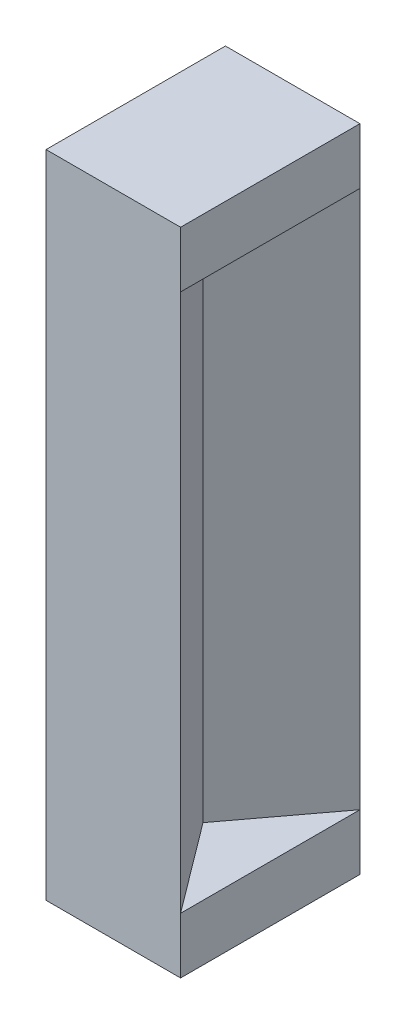
ISO-10303-21;
HEADER;
FILE_DESCRIPTION(('STEP AP214'),'2;1');
FILE_NAME('part.step','',(''),(''),'','','');
FILE_SCHEMA(('AUTOMOTIVE_DESIGN { 1 0 10303 214 1 1 1 1 }'));
ENDSEC;
DATA;
#1=APPLICATION_CONTEXT('core data for automotive mechanical design processes');
#2=APPLICATION_PROTOCOL_DEFINITION('international standard','automotive_design',2000,#1);
#3=PRODUCT_CONTEXT('',#1,'mechanical');
#4=PRODUCT('Part','Part','',(#3));
#5=PRODUCT_RELATED_PRODUCT_CATEGORY('part','',(#4));
#6=PRODUCT_DEFINITION_FORMATION('','',#4);
#7=PRODUCT_DEFINITION_CONTEXT('part definition',#1,'design');
#8=PRODUCT_DEFINITION('design','',#6,#7);
#9=PRODUCT_DEFINITION_SHAPE('','',#8);
#10=(LENGTH_UNIT() NAMED_UNIT(*) SI_UNIT(.MILLI.,.METRE.));
#11=(NAMED_UNIT(*) PLANE_ANGLE_UNIT() SI_UNIT($,.RADIAN.));
#12=(NAMED_UNIT(*) SI_UNIT($,.STERADIAN.) SOLID_ANGLE_UNIT());
#13=UNCERTAINTY_MEASURE_WITH_UNIT(LENGTH_MEASURE(1.E-05),#10,'distance_accuracy_value','');
#14=(GEOMETRIC_REPRESENTATION_CONTEXT(3) GLOBAL_UNCERTAINTY_ASSIGNED_CONTEXT((#13)) GLOBAL_UNIT_ASSIGNED_CONTEXT((#10,
#11,#12)) REPRESENTATION_CONTEXT('',''));
#15=CARTESIAN_POINT('',(0.,0.,0.));
#16=DIRECTION('',(0.,0.,1.));
#17=DIRECTION('',(1.,0.,0.));
#18=AXIS2_PLACEMENT_3D('',#15,#16,#17);
#19=CARTESIAN_POINT('',(0.,-266.540919600127,0.));
#20=DIRECTION('',(0.,1.,0.));
#21=DIRECTION('',(0.,0.,1.));
#22=AXIS2_PLACEMENT_3D('',#19,#20,#21);
#23=PLANE('',#22);
#24=DIRECTION('',(0.,0.,-1.));
#25=VECTOR('',#24,1.);
#26=CARTESIAN_POINT('',(180.,-266.540919600127,0.));
#27=LINE('',#26,#25);
#28=CARTESIAN_POINT('',(180.,-266.540919600127,0.));
#29=VERTEX_POINT('',#28);
#30=CARTESIAN_POINT('',(180.,-266.540919600127,-80.));
#31=VERTEX_POINT('',#30);
#32=EDGE_CURVE('E115',#29,#31,#27,.T.);
#33=ORIENTED_EDGE('',*,*,#32,.T.);
#34=DIRECTION('',(0.6,0.,-0.8));
#35=VECTOR('',#34,1.);
#36=CARTESIAN_POINT('',(180.,-266.540919600127,-80.));
#37=LINE('',#36,#35);
#38=CARTESIAN_POINT('',(150.,-266.540919600127,-40.));
#39=VERTEX_POINT('',#38);
#40=EDGE_CURVE('E92',#39,#31,#37,.T.);
#41=ORIENTED_EDGE('',*,*,#40,.F.);
#42=DIRECTION('',(-0.6,0.,-0.8));
#43=VECTOR('',#42,1.);
#44=CARTESIAN_POINT('',(120.,-266.540919600127,-80.));
#45=LINE('',#44,#43);
#46=EDGE_CURVE('E120',#29,#39,#45,.T.);
#47=ORIENTED_EDGE('',*,*,#46,.F.);
#48=EDGE_LOOP('',(#33,#41,#47));
#49=FACE_BOUND('',#48,.T.);
#50=ADVANCED_FACE('F37',(#49),#23,.T.);
#51=CARTESIAN_POINT('',(120.,73.4590803998726,-80.));
#52=DIRECTION('',(-0.8,0.,0.6));
#53=DIRECTION('',(0.6,0.,0.8));
#54=AXIS2_PLACEMENT_3D('',#51,#52,#53);
#55=PLANE('',#54);
#56=DIRECTION('',(0.,-1.,0.));
#57=VECTOR('',#56,1.);
#58=CARTESIAN_POINT('',(150.,73.4590803998726,-40.));
#59=LINE('',#58,#57);
#60=CARTESIAN_POINT('',(150.,-26.5409196001273,-40.));
#61=VERTEX_POINT('',#60);
#62=EDGE_CURVE('E98',#61,#39,#59,.T.);
#63=ORIENTED_EDGE('',*,*,#62,.F.);
#64=DIRECTION('',(0.6,0.,0.8));
#65=VECTOR('',#64,1.);
#66=CARTESIAN_POINT('',(120.,-26.5409196001273,-80.));
#67=LINE('',#66,#65);
#68=CARTESIAN_POINT('',(180.,-26.5409196001273,0.));
#69=VERTEX_POINT('',#68);
#70=EDGE_CURVE('E121',#61,#69,#67,.T.);
#71=ORIENTED_EDGE('',*,*,#70,.T.);
#72=DIRECTION('',(0.,-1.,0.));
#73=VECTOR('',#72,1.);
#74=CARTESIAN_POINT('',(180.,73.4590803998726,0.));
#75=LINE('',#74,#73);
#76=EDGE_CURVE('E125',#69,#29,#75,.T.);
#77=ORIENTED_EDGE('',*,*,#76,.T.);
#78=ORIENTED_EDGE('',*,*,#46,.T.);
#79=EDGE_LOOP('',(#63,#71,#77,#78));
#80=FACE_BOUND('',#79,.T.);
#81=ADVANCED_FACE('F178',(#80),#55,.F.);
#82=CARTESIAN_POINT('',(0.,-26.5409196001273,0.));
#83=DIRECTION('',(0.,-1.,0.));
#84=DIRECTION('',(0.,0.,-1.));
#85=AXIS2_PLACEMENT_3D('',#82,#83,#84);
#86=PLANE('',#85);
#87=ORIENTED_EDGE('',*,*,#70,.F.);
#88=DIRECTION('',(-0.6,0.,0.8));
#89=VECTOR('',#88,1.);
#90=CARTESIAN_POINT('',(180.,-26.5409196001273,-80.));
#91=LINE('',#90,#89);
#92=CARTESIAN_POINT('',(180.,-26.5409196001273,-80.));
#93=VERTEX_POINT('',#92);
#94=EDGE_CURVE('E113',#93,#61,#91,.T.);
#95=ORIENTED_EDGE('',*,*,#94,.F.);
#96=DIRECTION('',(0.,0.,-1.));
#97=VECTOR('',#96,1.);
#98=CARTESIAN_POINT('',(180.,-26.5409196001273,-80.));
#99=LINE('',#98,#97);
#100=EDGE_CURVE('E150',#69,#93,#99,.T.);
#101=ORIENTED_EDGE('',*,*,#100,.F.);
#102=EDGE_LOOP('',(#87,#95,#101));
#103=FACE_BOUND('',#102,.T.);
#104=ADVANCED_FACE('F182',(#103),#86,.T.);
#105=CARTESIAN_POINT('',(180.,-291.540919600127,0.));
#106=DIRECTION('',(1.,0.,0.));
#107=DIRECTION('',(0.,0.,-1.));
#108=AXIS2_PLACEMENT_3D('',#105,#106,#107);
#109=PLANE('',#108);
#110=ORIENTED_EDGE('',*,*,#32,.F.);
#111=DIRECTION('',(0.,1.,0.));
#112=VECTOR('',#111,1.);
#113=CARTESIAN_POINT('',(180.,-291.540919600127,0.));
#114=LINE('',#113,#112);
#115=CARTESIAN_POINT('',(180.,-291.540919600127,0.));
#116=VERTEX_POINT('',#115);
#117=EDGE_CURVE('E11',#116,#29,#114,.T.);
#118=ORIENTED_EDGE('',*,*,#117,.F.);
#119=DIRECTION('',(0.,0.,-1.));
#120=VECTOR('',#119,1.);
#121=CARTESIAN_POINT('',(180.,-291.540919600127,0.));
#122=LINE('',#121,#120);
#123=CARTESIAN_POINT('',(180.,-291.540919600127,-80.));
#124=VERTEX_POINT('',#123);
#125=EDGE_CURVE('E117',#116,#124,#122,.T.);
#126=ORIENTED_EDGE('',*,*,#125,.T.);
#127=DIRECTION('',(0.,1.,0.));
#128=VECTOR('',#127,1.);
#129=CARTESIAN_POINT('',(180.,-291.540919600127,-80.));
#130=LINE('',#129,#128);
#131=EDGE_CURVE('E41',#124,#31,#130,.T.);
#132=ORIENTED_EDGE('',*,*,#131,.T.);
#133=EDGE_LOOP('',(#110,#118,#126,#132));
#134=FACE_BOUND('',#133,.T.);
#135=ADVANCED_FACE('F39',(#134),#109,.T.);
#136=CARTESIAN_POINT('',(120.,-291.540919600127,0.));
#137=DIRECTION('',(0.,0.,1.));
#138=DIRECTION('',(1.,0.,0.));
#139=AXIS2_PLACEMENT_3D('',#136,#137,#138);
#140=PLANE('',#139);
#141=ORIENTED_EDGE('',*,*,#117,.T.);
#142=ORIENTED_EDGE('',*,*,#76,.F.);
#143=DIRECTION('',(0.,-1.,0.));
#144=VECTOR('',#143,1.);
#145=CARTESIAN_POINT('',(180.,-1.54091960012736,0.));
#146=LINE('',#145,#144);
#147=CARTESIAN_POINT('',(180.,-1.54091960012736,0.));
#148=VERTEX_POINT('',#147);
#149=EDGE_CURVE('E146',#148,#69,#146,.T.);
#150=ORIENTED_EDGE('',*,*,#149,.F.);
#151=DIRECTION('',(1.,0.,0.));
#152=VECTOR('',#151,1.);
#153=CARTESIAN_POINT('',(180.,-1.54091960012736,0.));
#154=LINE('',#153,#152);
#155=CARTESIAN_POINT('',(120.,-1.54091960012736,0.));
#156=VERTEX_POINT('',#155);
#157=EDGE_CURVE('E152',#156,#148,#154,.T.);
#158=ORIENTED_EDGE('',*,*,#157,.F.);
#159=DIRECTION('',(0.,1.,0.));
#160=VECTOR('',#159,1.);
#161=CARTESIAN_POINT('',(120.,-291.540919600127,0.));
#162=LINE('',#161,#160);
#163=CARTESIAN_POINT('',(120.,-291.540919600127,0.));
#164=VERTEX_POINT('',#163);
#165=EDGE_CURVE('E47',#164,#156,#162,.T.);
#166=ORIENTED_EDGE('',*,*,#165,.F.);
#167=DIRECTION('',(1.,0.,0.));
#168=VECTOR('',#167,1.);
#169=CARTESIAN_POINT('',(120.,-291.540919600127,0.));
#170=LINE('',#169,#168);
#171=EDGE_CURVE('E119',#164,#116,#170,.T.);
#172=ORIENTED_EDGE('',*,*,#171,.T.);
#173=EDGE_LOOP('',(#141,#142,#150,#158,#166,#172));
#174=FACE_BOUND('',#173,.T.);
#175=ADVANCED_FACE('F162',(#174),#140,.T.);
#176=CARTESIAN_POINT('',(120.,-291.540919600127,-80.));
#177=DIRECTION('',(-1.,0.,0.));
#178=DIRECTION('',(0.,0.,1.));
#179=AXIS2_PLACEMENT_3D('',#176,#177,#178);
#180=PLANE('',#179);
#181=ORIENTED_EDGE('',*,*,#165,.T.);
#182=DIRECTION('',(0.,0.,1.));
#183=VECTOR('',#182,1.);
#184=CARTESIAN_POINT('',(120.,-1.54091960012736,0.));
#185=LINE('',#184,#183);
#186=CARTESIAN_POINT('',(120.,-1.54091960012735,-80.));
#187=VERTEX_POINT('',#186);
#188=EDGE_CURVE('E140',#187,#156,#185,.T.);
#189=ORIENTED_EDGE('',*,*,#188,.F.);
#190=DIRECTION('',(0.,1.,0.));
#191=VECTOR('',#190,1.);
#192=CARTESIAN_POINT('',(120.,-291.540919600127,-80.));
#193=LINE('',#192,#191);
#194=CARTESIAN_POINT('',(120.,-291.540919600127,-80.));
#195=VERTEX_POINT('',#194);
#196=EDGE_CURVE('E118',#195,#187,#193,.T.);
#197=ORIENTED_EDGE('',*,*,#196,.F.);
#198=DIRECTION('',(0.,0.,1.));
#199=VECTOR('',#198,1.);
#200=CARTESIAN_POINT('',(120.,-291.540919600127,-80.));
#201=LINE('',#200,#199);
#202=EDGE_CURVE('E158',#195,#164,#201,.T.);
#203=ORIENTED_EDGE('',*,*,#202,.T.);
#204=EDGE_LOOP('',(#181,#189,#197,#203));
#205=FACE_BOUND('',#204,.T.);
#206=ADVANCED_FACE('F144',(#205),#180,.T.);
#207=CARTESIAN_POINT('',(180.,-291.540919600127,-80.));
#208=DIRECTION('',(0.,0.,-1.));
#209=DIRECTION('',(0.,1.,0.));
#210=AXIS2_PLACEMENT_3D('',#207,#208,#209);
#211=PLANE('',#210);
#212=ORIENTED_EDGE('',*,*,#196,.T.);
#213=DIRECTION('',(-1.,0.,0.));
#214=VECTOR('',#213,1.);
#215=CARTESIAN_POINT('',(120.,-1.54091960012735,-80.));
#216=LINE('',#215,#214);
#217=CARTESIAN_POINT('',(180.,-1.54091960012735,-80.));
#218=VERTEX_POINT('',#217);
#219=EDGE_CURVE('E131',#218,#187,#216,.T.);
#220=ORIENTED_EDGE('',*,*,#219,.F.);
#221=DIRECTION('',(0.,-1.,0.));
#222=VECTOR('',#221,1.);
#223=CARTESIAN_POINT('',(180.,-1.54091960012735,-80.));
#224=LINE('',#223,#222);
#225=EDGE_CURVE('E112',#218,#93,#224,.T.);
#226=ORIENTED_EDGE('',*,*,#225,.T.);
#227=DIRECTION('',(0.,-1.,0.));
#228=VECTOR('',#227,1.);
#229=CARTESIAN_POINT('',(180.,73.4590803998726,-80.));
#230=LINE('',#229,#228);
#231=EDGE_CURVE('E95',#93,#31,#230,.T.);
#232=ORIENTED_EDGE('',*,*,#231,.T.);
#233=ORIENTED_EDGE('',*,*,#131,.F.);
#234=DIRECTION('',(-1.,0.,0.));
#235=VECTOR('',#234,1.);
#236=CARTESIAN_POINT('',(180.,-291.540919600127,-80.));
#237=LINE('',#236,#235);
#238=EDGE_CURVE('E123',#124,#195,#237,.T.);
#239=ORIENTED_EDGE('',*,*,#238,.T.);
#240=EDGE_LOOP('',(#212,#220,#226,#232,#233,#239));
#241=FACE_BOUND('',#240,.T.);
#242=ADVANCED_FACE('F107',(#241),#211,.T.);
#243=CARTESIAN_POINT('',(0.,-291.540919600127,0.));
#244=DIRECTION('',(0.,1.,0.));
#245=DIRECTION('',(0.,0.,1.));
#246=AXIS2_PLACEMENT_3D('',#243,#244,#245);
#247=PLANE('',#246);
#248=ORIENTED_EDGE('',*,*,#125,.F.);
#249=ORIENTED_EDGE('',*,*,#171,.F.);
#250=ORIENTED_EDGE('',*,*,#202,.F.);
#251=ORIENTED_EDGE('',*,*,#238,.F.);
#252=EDGE_LOOP('',(#248,#249,#250,#251));
#253=FACE_BOUND('',#252,.T.);
#254=ADVANCED_FACE('F165',(#253),#247,.F.);
#255=CARTESIAN_POINT('',(180.,-1.54091960012735,-80.));
#256=DIRECTION('',(-1.,0.,0.));
#257=DIRECTION('',(0.,0.,1.));
#258=AXIS2_PLACEMENT_3D('',#255,#256,#257);
#259=PLANE('',#258);
#260=ORIENTED_EDGE('',*,*,#100,.T.);
#261=ORIENTED_EDGE('',*,*,#225,.F.);
#262=DIRECTION('',(0.,0.,-1.));
#263=VECTOR('',#262,1.);
#264=CARTESIAN_POINT('',(180.,-1.54091960012735,-80.));
#265=LINE('',#264,#263);
#266=EDGE_CURVE('E142',#148,#218,#265,.T.);
#267=ORIENTED_EDGE('',*,*,#266,.F.);
#268=ORIENTED_EDGE('',*,*,#149,.T.);
#269=EDGE_LOOP('',(#260,#261,#267,#268));
#270=FACE_BOUND('',#269,.T.);
#271=ADVANCED_FACE('F167',(#270),#259,.F.);
#272=CARTESIAN_POINT('',(0.,-1.54091960012736,0.));
#273=DIRECTION('',(0.,-1.,0.));
#274=DIRECTION('',(0.,0.,-1.));
#275=AXIS2_PLACEMENT_3D('',#272,#273,#274);
#276=PLANE('',#275);
#277=ORIENTED_EDGE('',*,*,#157,.T.);
#278=ORIENTED_EDGE('',*,*,#266,.T.);
#279=ORIENTED_EDGE('',*,*,#219,.T.);
#280=ORIENTED_EDGE('',*,*,#188,.T.);
#281=EDGE_LOOP('',(#277,#278,#279,#280));
#282=FACE_BOUND('',#281,.T.);
#283=ADVANCED_FACE('F139',(#282),#276,.F.);
#284=CARTESIAN_POINT('',(180.,73.4590803998726,-80.));
#285=DIRECTION('',(-0.8,0.,-0.6));
#286=DIRECTION('',(-0.6,0.,0.8));
#287=AXIS2_PLACEMENT_3D('',#284,#285,#286);
#288=PLANE('',#287);
#289=ORIENTED_EDGE('',*,*,#94,.T.);
#290=ORIENTED_EDGE('',*,*,#62,.T.);
#291=ORIENTED_EDGE('',*,*,#40,.T.);
#292=ORIENTED_EDGE('',*,*,#231,.F.);
#293=EDGE_LOOP('',(#289,#290,#291,#292));
#294=FACE_BOUND('',#293,.T.);
#295=ADVANCED_FACE('F94',(#294),#288,.F.);
#296=CLOSED_SHELL('',(#50,#81,#104,#135,#175,#206,#242,#254,#271,#283,#295));
#297=MANIFOLD_SOLID_BREP('B2',#296);
#298=ADVANCED_BREP_SHAPE_REPRESENTATION('',(#18,#297),#14);
#299=SHAPE_DEFINITION_REPRESENTATION(#9,#298);
ENDSEC;
END-ISO-10303-21;
